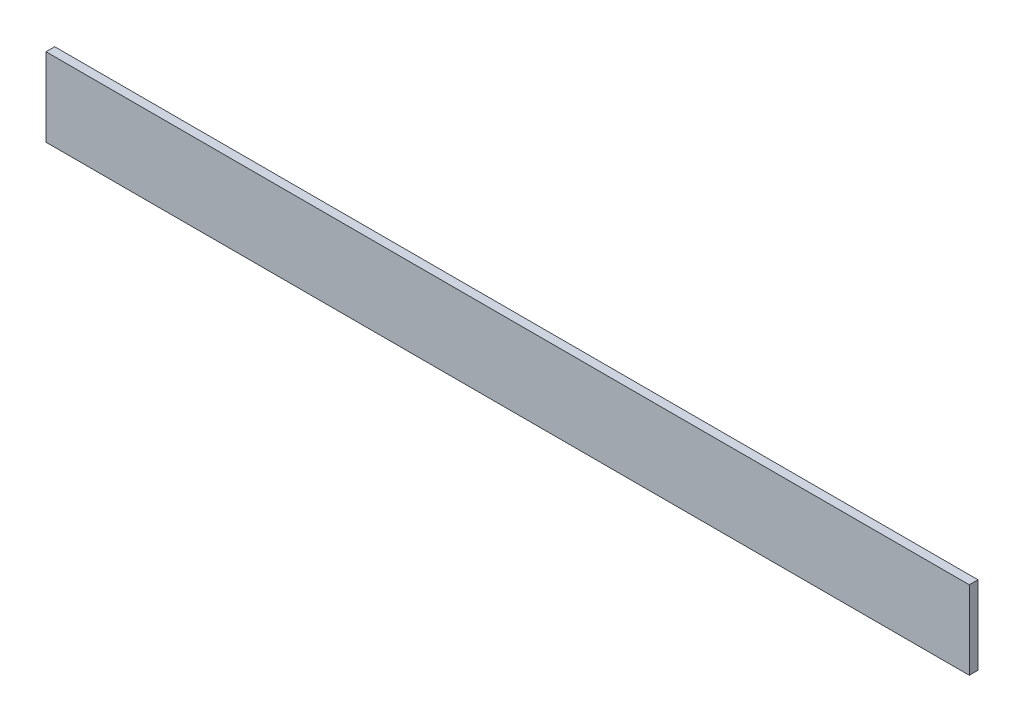
ISO-10303-21;
HEADER;
FILE_DESCRIPTION(('STEP AP214'),'2;1');
FILE_NAME('part.step','',(''),(''),'','','');
FILE_SCHEMA(('AUTOMOTIVE_DESIGN { 1 0 10303 214 1 1 1 1 }'));
ENDSEC;
DATA;
#1=APPLICATION_CONTEXT('core data for automotive mechanical design processes');
#2=APPLICATION_PROTOCOL_DEFINITION('international standard','automotive_design',2000,#1);
#3=PRODUCT_CONTEXT('',#1,'mechanical');
#4=PRODUCT('Part','Part','',(#3));
#5=PRODUCT_RELATED_PRODUCT_CATEGORY('part','',(#4));
#6=PRODUCT_DEFINITION_FORMATION('','',#4);
#7=PRODUCT_DEFINITION_CONTEXT('part definition',#1,'design');
#8=PRODUCT_DEFINITION('design','',#6,#7);
#9=PRODUCT_DEFINITION_SHAPE('','',#8);
#10=(LENGTH_UNIT() NAMED_UNIT(*) SI_UNIT(.MILLI.,.METRE.));
#11=(NAMED_UNIT(*) PLANE_ANGLE_UNIT() SI_UNIT($,.RADIAN.));
#12=(NAMED_UNIT(*) SI_UNIT($,.STERADIAN.) SOLID_ANGLE_UNIT());
#13=UNCERTAINTY_MEASURE_WITH_UNIT(LENGTH_MEASURE(1.E-05),#10,'distance_accuracy_value','');
#14=(GEOMETRIC_REPRESENTATION_CONTEXT(3) GLOBAL_UNCERTAINTY_ASSIGNED_CONTEXT((#13)) GLOBAL_UNIT_ASSIGNED_CONTEXT((#10,
#11,#12)) REPRESENTATION_CONTEXT('',''));
#15=CARTESIAN_POINT('',(0.,0.,0.));
#16=DIRECTION('',(0.,0.,1.));
#17=DIRECTION('',(1.,0.,0.));
#18=AXIS2_PLACEMENT_3D('',#15,#16,#17);
#19=CARTESIAN_POINT('',(-1060.,89.9999999999998,10.));
#20=DIRECTION('',(1.,0.,0.));
#21=DIRECTION('',(0.,0.,-1.));
#22=AXIS2_PLACEMENT_3D('',#19,#20,#21);
#23=PLANE('',#22);
#24=DIRECTION('',(0.,-1.,0.));
#25=VECTOR('',#24,1.);
#26=CARTESIAN_POINT('',(-1060.,89.9999999999998,-10.));
#27=LINE('',#26,#25);
#28=CARTESIAN_POINT('',(-1060.,89.9999999999998,-10.));
#29=VERTEX_POINT('',#28);
#30=CARTESIAN_POINT('',(-1060.,-90.0000000000001,-10.));
#31=VERTEX_POINT('',#30);
#32=EDGE_CURVE('E113',#29,#31,#27,.T.);
#33=ORIENTED_EDGE('',*,*,#32,.T.);
#34=DIRECTION('',(0.,0.,-1.));
#35=VECTOR('',#34,1.);
#36=CARTESIAN_POINT('',(-1060.,-90.0000000000001,10.));
#37=LINE('',#36,#35);
#38=CARTESIAN_POINT('',(-1060.,-90.0000000000001,10.));
#39=VERTEX_POINT('',#38);
#40=EDGE_CURVE('E11',#39,#31,#37,.T.);
#41=ORIENTED_EDGE('',*,*,#40,.F.);
#42=DIRECTION('',(0.,-1.,0.));
#43=VECTOR('',#42,1.);
#44=CARTESIAN_POINT('',(-1060.,89.9999999999998,10.));
#45=LINE('',#44,#43);
#46=CARTESIAN_POINT('',(-1060.,89.9999999999998,10.));
#47=VERTEX_POINT('',#46);
#48=EDGE_CURVE('E97',#47,#39,#45,.T.);
#49=ORIENTED_EDGE('',*,*,#48,.F.);
#50=DIRECTION('',(0.,0.,-1.));
#51=VECTOR('',#50,1.);
#52=CARTESIAN_POINT('',(-1060.,89.9999999999998,10.));
#53=LINE('',#52,#51);
#54=EDGE_CURVE('E109',#47,#29,#53,.T.);
#55=ORIENTED_EDGE('',*,*,#54,.T.);
#56=EDGE_LOOP('',(#33,#41,#49,#55));
#57=FACE_BOUND('',#56,.T.);
#58=ADVANCED_FACE('F45',(#57),#23,.F.);
#59=CARTESIAN_POINT('',(1060.,-89.9999999999999,10.));
#60=DIRECTION('',(0.,1.,0.));
#61=DIRECTION('',(-1.,0.,0.));
#62=AXIS2_PLACEMENT_3D('',#59,#60,#61);
#63=PLANE('',#62);
#64=DIRECTION('',(1.,0.,0.));
#65=VECTOR('',#64,1.);
#66=CARTESIAN_POINT('',(1060.,-89.9999999999999,-10.));
#67=LINE('',#66,#65);
#68=CARTESIAN_POINT('',(1060.,-89.9999999999999,-10.));
#69=VERTEX_POINT('',#68);
#70=EDGE_CURVE('E102',#31,#69,#67,.T.);
#71=ORIENTED_EDGE('',*,*,#70,.T.);
#72=DIRECTION('',(0.,0.,-1.));
#73=VECTOR('',#72,1.);
#74=CARTESIAN_POINT('',(1060.,-89.9999999999999,10.));
#75=LINE('',#74,#73);
#76=CARTESIAN_POINT('',(1060.,-89.9999999999999,10.));
#77=VERTEX_POINT('',#76);
#78=EDGE_CURVE('E54',#77,#69,#75,.T.);
#79=ORIENTED_EDGE('',*,*,#78,.F.);
#80=DIRECTION('',(1.,0.,0.));
#81=VECTOR('',#80,1.);
#82=CARTESIAN_POINT('',(1060.,-89.9999999999999,10.));
#83=LINE('',#82,#81);
#84=EDGE_CURVE('E92',#39,#77,#83,.T.);
#85=ORIENTED_EDGE('',*,*,#84,.F.);
#86=ORIENTED_EDGE('',*,*,#40,.T.);
#87=EDGE_LOOP('',(#71,#79,#85,#86));
#88=FACE_BOUND('',#87,.T.);
#89=ADVANCED_FACE('F101',(#88),#63,.F.);
#90=CARTESIAN_POINT('',(1060.,90.0000000000001,10.));
#91=DIRECTION('',(-1.,0.,0.));
#92=DIRECTION('',(0.,0.,1.));
#93=AXIS2_PLACEMENT_3D('',#90,#91,#92);
#94=PLANE('',#93);
#95=DIRECTION('',(0.,1.,0.));
#96=VECTOR('',#95,1.);
#97=CARTESIAN_POINT('',(1060.,90.0000000000001,-10.));
#98=LINE('',#97,#96);
#99=CARTESIAN_POINT('',(1060.,90.0000000000001,-10.));
#100=VERTEX_POINT('',#99);
#101=EDGE_CURVE('E79',#69,#100,#98,.T.);
#102=ORIENTED_EDGE('',*,*,#101,.T.);
#103=DIRECTION('',(0.,0.,-1.));
#104=VECTOR('',#103,1.);
#105=CARTESIAN_POINT('',(1060.,90.0000000000001,10.));
#106=LINE('',#105,#104);
#107=CARTESIAN_POINT('',(1060.,90.0000000000001,10.));
#108=VERTEX_POINT('',#107);
#109=EDGE_CURVE('E104',#108,#100,#106,.T.);
#110=ORIENTED_EDGE('',*,*,#109,.F.);
#111=DIRECTION('',(0.,1.,0.));
#112=VECTOR('',#111,1.);
#113=CARTESIAN_POINT('',(1060.,90.0000000000001,10.));
#114=LINE('',#113,#112);
#115=EDGE_CURVE('E95',#77,#108,#114,.T.);
#116=ORIENTED_EDGE('',*,*,#115,.F.);
#117=ORIENTED_EDGE('',*,*,#78,.T.);
#118=EDGE_LOOP('',(#102,#110,#116,#117));
#119=FACE_BOUND('',#118,.T.);
#120=ADVANCED_FACE('F105',(#119),#94,.F.);
#121=CARTESIAN_POINT('',(1060.,90.0000000000001,10.));
#122=DIRECTION('',(0.,-1.,0.));
#123=DIRECTION('',(1.,0.,0.));
#124=AXIS2_PLACEMENT_3D('',#121,#122,#123);
#125=PLANE('',#124);
#126=DIRECTION('',(-1.,0.,0.));
#127=VECTOR('',#126,1.);
#128=CARTESIAN_POINT('',(1060.,90.0000000000001,-10.));
#129=LINE('',#128,#127);
#130=EDGE_CURVE('E85',#100,#29,#129,.T.);
#131=ORIENTED_EDGE('',*,*,#130,.T.);
#132=ORIENTED_EDGE('',*,*,#54,.F.);
#133=DIRECTION('',(-1.,0.,0.));
#134=VECTOR('',#133,1.);
#135=CARTESIAN_POINT('',(1060.,90.0000000000001,10.));
#136=LINE('',#135,#134);
#137=EDGE_CURVE('E62',#108,#47,#136,.T.);
#138=ORIENTED_EDGE('',*,*,#137,.F.);
#139=ORIENTED_EDGE('',*,*,#109,.T.);
#140=EDGE_LOOP('',(#131,#132,#138,#139));
#141=FACE_BOUND('',#140,.T.);
#142=ADVANCED_FACE('F126',(#141),#125,.F.);
#143=CARTESIAN_POINT('',(0.,0.,10.));
#144=DIRECTION('',(0.,0.,-1.));
#145=DIRECTION('',(-1.,0.,0.));
#146=AXIS2_PLACEMENT_3D('',#143,#144,#145);
#147=PLANE('',#146);
#148=ORIENTED_EDGE('',*,*,#48,.T.);
#149=ORIENTED_EDGE('',*,*,#84,.T.);
#150=ORIENTED_EDGE('',*,*,#115,.T.);
#151=ORIENTED_EDGE('',*,*,#137,.T.);
#152=EDGE_LOOP('',(#148,#149,#150,#151));
#153=FACE_BOUND('',#152,.T.);
#154=ADVANCED_FACE('F93',(#153),#147,.F.);
#155=CARTESIAN_POINT('',(0.,0.,-10.));
#156=DIRECTION('',(0.,0.,-1.));
#157=DIRECTION('',(-1.,0.,0.));
#158=AXIS2_PLACEMENT_3D('',#155,#156,#157);
#159=PLANE('',#158);
#160=ORIENTED_EDGE('',*,*,#32,.F.);
#161=ORIENTED_EDGE('',*,*,#130,.F.);
#162=ORIENTED_EDGE('',*,*,#101,.F.);
#163=ORIENTED_EDGE('',*,*,#70,.F.);
#164=EDGE_LOOP('',(#160,#161,#162,#163));
#165=FACE_BOUND('',#164,.T.);
#166=ADVANCED_FACE('F129',(#165),#159,.T.);
#167=CLOSED_SHELL('',(#58,#89,#120,#142,#154,#166));
#168=MANIFOLD_SOLID_BREP('B2',#167);
#169=ADVANCED_BREP_SHAPE_REPRESENTATION('',(#18,#168),#14);
#170=SHAPE_DEFINITION_REPRESENTATION(#9,#169);
ENDSEC;
END-ISO-10303-21;
